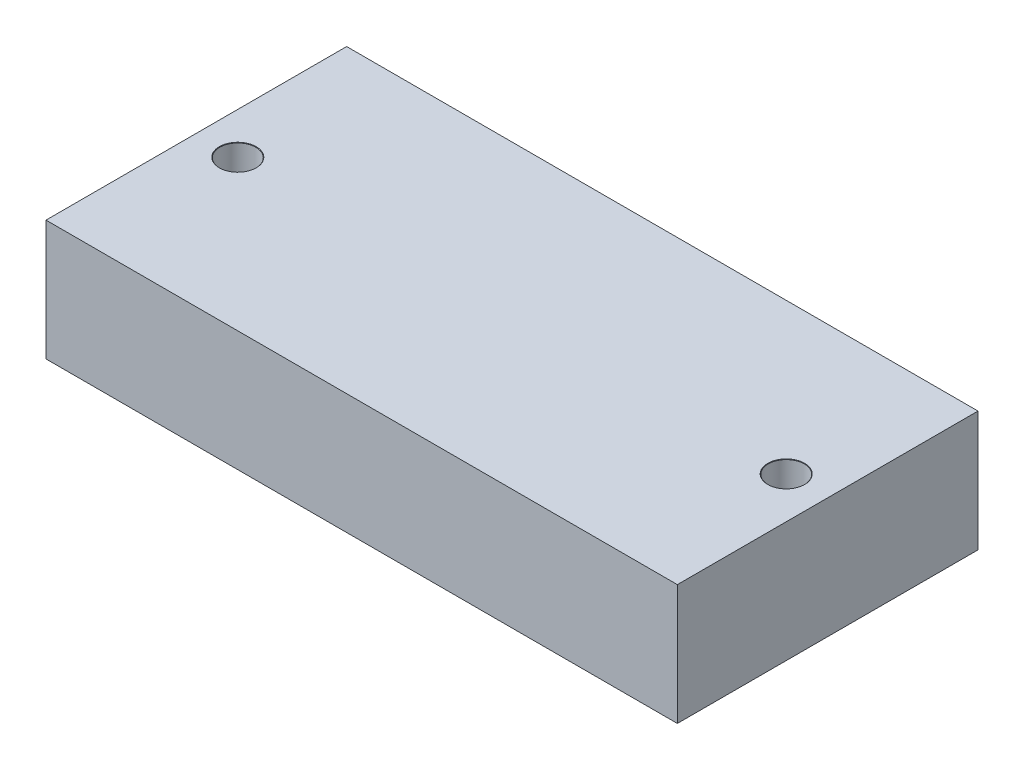
ISO-10303-21;
HEADER;
FILE_DESCRIPTION(('STEP AP214'),'2;1');
FILE_NAME('part.step','',(''),(''),'','','');
FILE_SCHEMA(('AUTOMOTIVE_DESIGN { 1 0 10303 214 1 1 1 1 }'));
ENDSEC;
DATA;
#1=APPLICATION_CONTEXT('core data for automotive mechanical design processes');
#2=APPLICATION_PROTOCOL_DEFINITION('international standard','automotive_design',2000,#1);
#3=PRODUCT_CONTEXT('',#1,'mechanical');
#4=PRODUCT('Part','Part','',(#3));
#5=PRODUCT_RELATED_PRODUCT_CATEGORY('part','',(#4));
#6=PRODUCT_DEFINITION_FORMATION('','',#4);
#7=PRODUCT_DEFINITION_CONTEXT('part definition',#1,'design');
#8=PRODUCT_DEFINITION('design','',#6,#7);
#9=PRODUCT_DEFINITION_SHAPE('','',#8);
#10=(LENGTH_UNIT() NAMED_UNIT(*) SI_UNIT(.MILLI.,.METRE.));
#11=(NAMED_UNIT(*) PLANE_ANGLE_UNIT() SI_UNIT($,.RADIAN.));
#12=(NAMED_UNIT(*) SI_UNIT($,.STERADIAN.) SOLID_ANGLE_UNIT());
#13=UNCERTAINTY_MEASURE_WITH_UNIT(LENGTH_MEASURE(1.E-05),#10,'distance_accuracy_value','');
#14=(GEOMETRIC_REPRESENTATION_CONTEXT(3) GLOBAL_UNCERTAINTY_ASSIGNED_CONTEXT((#13)) GLOBAL_UNIT_ASSIGNED_CONTEXT((#10,
#11,#12)) REPRESENTATION_CONTEXT('',''));
#15=CARTESIAN_POINT('',(0.,0.,0.));
#16=DIRECTION('',(0.,0.,1.));
#17=DIRECTION('',(1.,0.,0.));
#18=AXIS2_PLACEMENT_3D('',#15,#16,#17);
#19=CARTESIAN_POINT('',(-21.,8.,-9.99999999999999));
#20=DIRECTION('',(1.,0.,0.));
#21=DIRECTION('',(0.,0.,-1.));
#22=AXIS2_PLACEMENT_3D('',#19,#20,#21);
#23=PLANE('',#22);
#24=DIRECTION('',(0.,0.,1.));
#25=VECTOR('',#24,1.);
#26=CARTESIAN_POINT('',(-21.,0.,-9.99999999999999));
#27=LINE('',#26,#25);
#28=CARTESIAN_POINT('',(-21.,0.,-9.99999999999999));
#29=VERTEX_POINT('',#28);
#30=CARTESIAN_POINT('',(-21.,0.,10.));
#31=VERTEX_POINT('',#30);
#32=EDGE_CURVE('E96',#29,#31,#27,.T.);
#33=ORIENTED_EDGE('',*,*,#32,.T.);
#34=DIRECTION('',(0.,-1.,0.));
#35=VECTOR('',#34,1.);
#36=CARTESIAN_POINT('',(-21.,8.,10.));
#37=LINE('',#36,#35);
#38=CARTESIAN_POINT('',(-21.,8.,10.));
#39=VERTEX_POINT('',#38);
#40=EDGE_CURVE('E11',#39,#31,#37,.T.);
#41=ORIENTED_EDGE('',*,*,#40,.F.);
#42=DIRECTION('',(0.,0.,1.));
#43=VECTOR('',#42,1.);
#44=CARTESIAN_POINT('',(-21.,8.,-9.99999999999999));
#45=LINE('',#44,#43);
#46=CARTESIAN_POINT('',(-21.,8.,-9.99999999999999));
#47=VERTEX_POINT('',#46);
#48=EDGE_CURVE('E84',#47,#39,#45,.T.);
#49=ORIENTED_EDGE('',*,*,#48,.F.);
#50=DIRECTION('',(0.,-1.,0.));
#51=VECTOR('',#50,1.);
#52=CARTESIAN_POINT('',(-21.,8.,-9.99999999999999));
#53=LINE('',#52,#51);
#54=EDGE_CURVE('E92',#47,#29,#53,.T.);
#55=ORIENTED_EDGE('',*,*,#54,.T.);
#56=EDGE_LOOP('',(#33,#41,#49,#55));
#57=FACE_BOUND('',#56,.T.);
#58=ADVANCED_FACE('F33',(#57),#23,.F.);
#59=CARTESIAN_POINT('',(21.,8.,10.));
#60=DIRECTION('',(0.,0.,-1.));
#61=DIRECTION('',(-1.,0.,0.));
#62=AXIS2_PLACEMENT_3D('',#59,#60,#61);
#63=PLANE('',#62);
#64=DIRECTION('',(1.,0.,0.));
#65=VECTOR('',#64,1.);
#66=CARTESIAN_POINT('',(21.,0.,10.));
#67=LINE('',#66,#65);
#68=CARTESIAN_POINT('',(21.,0.,10.));
#69=VERTEX_POINT('',#68);
#70=EDGE_CURVE('E88',#31,#69,#67,.T.);
#71=ORIENTED_EDGE('',*,*,#70,.T.);
#72=DIRECTION('',(0.,-1.,0.));
#73=VECTOR('',#72,1.);
#74=CARTESIAN_POINT('',(21.,8.,10.));
#75=LINE('',#74,#73);
#76=CARTESIAN_POINT('',(21.,8.,10.));
#77=VERTEX_POINT('',#76);
#78=EDGE_CURVE('E41',#77,#69,#75,.T.);
#79=ORIENTED_EDGE('',*,*,#78,.F.);
#80=DIRECTION('',(1.,0.,0.));
#81=VECTOR('',#80,1.);
#82=CARTESIAN_POINT('',(21.,8.,10.));
#83=LINE('',#82,#81);
#84=EDGE_CURVE('E79',#39,#77,#83,.T.);
#85=ORIENTED_EDGE('',*,*,#84,.F.);
#86=ORIENTED_EDGE('',*,*,#40,.T.);
#87=EDGE_LOOP('',(#71,#79,#85,#86));
#88=FACE_BOUND('',#87,.T.);
#89=ADVANCED_FACE('F87',(#88),#63,.F.);
#90=CARTESIAN_POINT('',(21.,8.,-9.99999999999999));
#91=DIRECTION('',(-1.,0.,0.));
#92=DIRECTION('',(0.,0.,1.));
#93=AXIS2_PLACEMENT_3D('',#90,#91,#92);
#94=PLANE('',#93);
#95=DIRECTION('',(0.,0.,-1.));
#96=VECTOR('',#95,1.);
#97=CARTESIAN_POINT('',(21.,0.,-9.99999999999999));
#98=LINE('',#97,#96);
#99=CARTESIAN_POINT('',(21.,0.,-9.99999999999999));
#100=VERTEX_POINT('',#99);
#101=EDGE_CURVE('E66',#69,#100,#98,.T.);
#102=ORIENTED_EDGE('',*,*,#101,.T.);
#103=DIRECTION('',(0.,-1.,0.));
#104=VECTOR('',#103,1.);
#105=CARTESIAN_POINT('',(21.,8.,-9.99999999999999));
#106=LINE('',#105,#104);
#107=CARTESIAN_POINT('',(21.,8.,-9.99999999999999));
#108=VERTEX_POINT('',#107);
#109=EDGE_CURVE('E89',#108,#100,#106,.T.);
#110=ORIENTED_EDGE('',*,*,#109,.F.);
#111=DIRECTION('',(0.,0.,-1.));
#112=VECTOR('',#111,1.);
#113=CARTESIAN_POINT('',(21.,8.,-9.99999999999999));
#114=LINE('',#113,#112);
#115=EDGE_CURVE('E82',#77,#108,#114,.T.);
#116=ORIENTED_EDGE('',*,*,#115,.F.);
#117=ORIENTED_EDGE('',*,*,#78,.T.);
#118=EDGE_LOOP('',(#102,#110,#116,#117));
#119=FACE_BOUND('',#118,.T.);
#120=ADVANCED_FACE('F90',(#119),#94,.F.);
#121=CARTESIAN_POINT('',(21.,8.,-9.99999999999999));
#122=DIRECTION('',(0.,0.,1.));
#123=DIRECTION('',(1.,0.,0.));
#124=AXIS2_PLACEMENT_3D('',#121,#122,#123);
#125=PLANE('',#124);
#126=DIRECTION('',(-1.,0.,0.));
#127=VECTOR('',#126,1.);
#128=CARTESIAN_POINT('',(21.,0.,-9.99999999999999));
#129=LINE('',#128,#127);
#130=EDGE_CURVE('E72',#100,#29,#129,.T.);
#131=ORIENTED_EDGE('',*,*,#130,.T.);
#132=ORIENTED_EDGE('',*,*,#54,.F.);
#133=DIRECTION('',(-1.,0.,0.));
#134=VECTOR('',#133,1.);
#135=CARTESIAN_POINT('',(21.,8.,-9.99999999999999));
#136=LINE('',#135,#134);
#137=EDGE_CURVE('E49',#108,#47,#136,.T.);
#138=ORIENTED_EDGE('',*,*,#137,.F.);
#139=ORIENTED_EDGE('',*,*,#109,.T.);
#140=EDGE_LOOP('',(#131,#132,#138,#139));
#141=FACE_BOUND('',#140,.T.);
#142=ADVANCED_FACE('F104',(#141),#125,.F.);
#143=CARTESIAN_POINT('',(0.,8.,0.));
#144=DIRECTION('',(0.,-1.,0.));
#145=DIRECTION('',(0.,0.,-1.));
#146=AXIS2_PLACEMENT_3D('',#143,#144,#145);
#147=PLANE('',#146);
#148=CARTESIAN_POINT('',(-18.2425,8.,0.));
#149=DIRECTION('',(0.,1.,0.));
#150=DIRECTION('',(0.,0.,1.));
#151=AXIS2_PLACEMENT_3D('',#148,#149,#150);
#152=CIRCLE('',#151,1.225);
#153=CARTESIAN_POINT('',(-18.2425,8.,1.225));
#154=VERTEX_POINT('',#153);
#155=EDGE_CURVE('E124',#154,#154,#152,.T.);
#156=ORIENTED_EDGE('',*,*,#155,.F.);
#157=EDGE_LOOP('',(#156));
#158=FACE_BOUND('',#157,.T.);
#159=CARTESIAN_POINT('',(18.2425,8.,0.));
#160=DIRECTION('',(0.,1.,0.));
#161=DIRECTION('',(0.,0.,1.));
#162=AXIS2_PLACEMENT_3D('',#159,#160,#161);
#163=CIRCLE('',#162,1.225);
#164=CARTESIAN_POINT('',(18.2425,8.,1.22499999999999));
#165=VERTEX_POINT('',#164);
#166=EDGE_CURVE('E115',#165,#165,#163,.T.);
#167=ORIENTED_EDGE('',*,*,#166,.F.);
#168=EDGE_LOOP('',(#167));
#169=FACE_BOUND('',#168,.T.);
#170=ORIENTED_EDGE('',*,*,#48,.T.);
#171=ORIENTED_EDGE('',*,*,#84,.T.);
#172=ORIENTED_EDGE('',*,*,#115,.T.);
#173=ORIENTED_EDGE('',*,*,#137,.T.);
#174=EDGE_LOOP('',(#170,#171,#172,#173));
#175=FACE_BOUND('',#174,.T.);
#176=ADVANCED_FACE('F80',(#158,#169,#175),#147,.F.);
#177=CARTESIAN_POINT('',(0.,0.,0.));
#178=DIRECTION('',(0.,-1.,0.));
#179=DIRECTION('',(0.,0.,-1.));
#180=AXIS2_PLACEMENT_3D('',#177,#178,#179);
#181=PLANE('',#180);
#182=CARTESIAN_POINT('',(-18.2425,0.,0.));
#183=DIRECTION('',(0.,1.,0.));
#184=DIRECTION('',(0.,0.,1.));
#185=AXIS2_PLACEMENT_3D('',#182,#183,#184);
#186=CIRCLE('',#185,1.2);
#187=CARTESIAN_POINT('',(-18.2425,0.,1.2));
#188=VERTEX_POINT('',#187);
#189=EDGE_CURVE('E118',#188,#188,#186,.T.);
#190=ORIENTED_EDGE('',*,*,#189,.T.);
#191=EDGE_LOOP('',(#190));
#192=FACE_BOUND('',#191,.T.);
#193=CARTESIAN_POINT('',(18.2425,0.,0.));
#194=DIRECTION('',(0.,1.,0.));
#195=DIRECTION('',(0.,0.,1.));
#196=AXIS2_PLACEMENT_3D('',#193,#194,#195);
#197=CIRCLE('',#196,1.2);
#198=CARTESIAN_POINT('',(18.2425,0.,1.19999999999999));
#199=VERTEX_POINT('',#198);
#200=EDGE_CURVE('E99',#199,#199,#197,.T.);
#201=ORIENTED_EDGE('',*,*,#200,.T.);
#202=EDGE_LOOP('',(#201));
#203=FACE_BOUND('',#202,.T.);
#204=ORIENTED_EDGE('',*,*,#32,.F.);
#205=ORIENTED_EDGE('',*,*,#130,.F.);
#206=ORIENTED_EDGE('',*,*,#101,.F.);
#207=ORIENTED_EDGE('',*,*,#70,.F.);
#208=EDGE_LOOP('',(#204,#205,#206,#207));
#209=FACE_BOUND('',#208,.T.);
#210=ADVANCED_FACE('F107',(#192,#203,#209),#181,.T.);
#211=CARTESIAN_POINT('',(18.2425,8.,0.));
#212=DIRECTION('',(0.,1.,0.));
#213=DIRECTION('',(0.,0.,1.));
#214=AXIS2_PLACEMENT_3D('',#211,#212,#213);
#215=CYLINDRICAL_SURFACE('',#214,1.2);
#216=ORIENTED_EDGE('',*,*,#200,.F.);
#217=EDGE_LOOP('',(#216));
#218=FACE_BOUND('',#217,.T.);
#219=CARTESIAN_POINT('',(18.2425,7.975,0.));
#220=DIRECTION('',(0.,1.,0.));
#221=DIRECTION('',(0.,0.,1.));
#222=AXIS2_PLACEMENT_3D('',#219,#220,#221);
#223=CIRCLE('',#222,1.2);
#224=CARTESIAN_POINT('',(18.2425,7.975,1.19999999999999));
#225=VERTEX_POINT('',#224);
#226=EDGE_CURVE('E112',#225,#225,#223,.T.);
#227=ORIENTED_EDGE('',*,*,#226,.T.);
#228=EDGE_LOOP('',(#227));
#229=FACE_BOUND('',#228,.T.);
#230=ADVANCED_FACE('F138',(#218,#229),#215,.F.);
#231=CARTESIAN_POINT('',(18.2425,8.,0.));
#232=DIRECTION('',(0.,1.,0.));
#233=DIRECTION('',(0.,0.,1.));
#234=AXIS2_PLACEMENT_3D('',#231,#232,#233);
#235=CONICAL_SURFACE('',#234,1.225,0.785398163397414);
#236=ORIENTED_EDGE('',*,*,#226,.F.);
#237=EDGE_LOOP('',(#236));
#238=FACE_BOUND('',#237,.T.);
#239=ORIENTED_EDGE('',*,*,#166,.T.);
#240=EDGE_LOOP('',(#239));
#241=FACE_BOUND('',#240,.T.);
#242=ADVANCED_FACE('F135',(#238,#241),#235,.F.);
#243=CARTESIAN_POINT('',(-18.2425,8.,0.));
#244=DIRECTION('',(0.,1.,0.));
#245=DIRECTION('',(0.,0.,1.));
#246=AXIS2_PLACEMENT_3D('',#243,#244,#245);
#247=CYLINDRICAL_SURFACE('',#246,1.2);
#248=ORIENTED_EDGE('',*,*,#189,.F.);
#249=EDGE_LOOP('',(#248));
#250=FACE_BOUND('',#249,.T.);
#251=CARTESIAN_POINT('',(-18.2425,7.975,0.));
#252=DIRECTION('',(0.,1.,0.));
#253=DIRECTION('',(0.,0.,1.));
#254=AXIS2_PLACEMENT_3D('',#251,#252,#253);
#255=CIRCLE('',#254,1.2);
#256=CARTESIAN_POINT('',(-18.2425,7.975,1.2));
#257=VERTEX_POINT('',#256);
#258=EDGE_CURVE('E121',#257,#257,#255,.T.);
#259=ORIENTED_EDGE('',*,*,#258,.T.);
#260=EDGE_LOOP('',(#259));
#261=FACE_BOUND('',#260,.T.);
#262=ADVANCED_FACE('F137',(#250,#261),#247,.F.);
#263=CARTESIAN_POINT('',(-18.2425,8.,0.));
#264=DIRECTION('',(0.,1.,0.));
#265=DIRECTION('',(0.,0.,1.));
#266=AXIS2_PLACEMENT_3D('',#263,#264,#265);
#267=CONICAL_SURFACE('',#266,1.225,0.785398163397414);
#268=ORIENTED_EDGE('',*,*,#258,.F.);
#269=EDGE_LOOP('',(#268));
#270=FACE_BOUND('',#269,.T.);
#271=ORIENTED_EDGE('',*,*,#155,.T.);
#272=EDGE_LOOP('',(#271));
#273=FACE_BOUND('',#272,.T.);
#274=ADVANCED_FACE('F128',(#270,#273),#267,.F.);
#275=CLOSED_SHELL('',(#58,#89,#120,#142,#176,#210,#230,#242,#262,#274));
#276=MANIFOLD_SOLID_BREP('B2',#275);
#277=ADVANCED_BREP_SHAPE_REPRESENTATION('',(#18,#276),#14);
#278=SHAPE_DEFINITION_REPRESENTATION(#9,#277);
ENDSEC;
END-ISO-10303-21;
